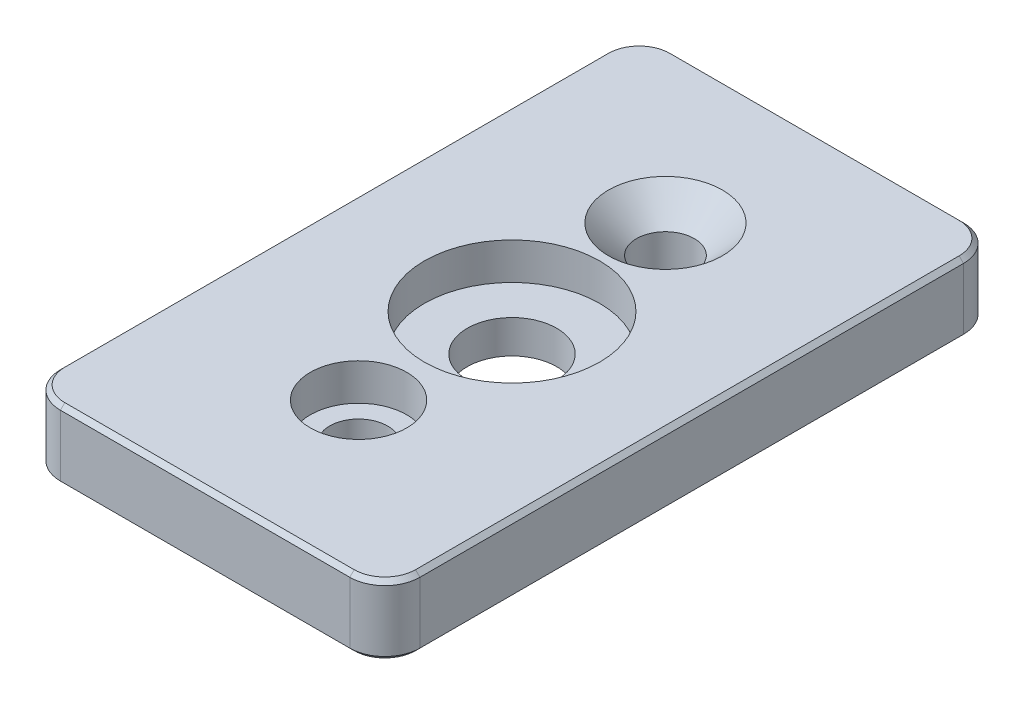
ISO-10303-21;
HEADER;
FILE_DESCRIPTION(('STEP AP214'),'2;1');
FILE_NAME('part.step','',(''),(''),'','','');
FILE_SCHEMA(('AUTOMOTIVE_DESIGN { 1 0 10303 214 1 1 1 1 }'));
ENDSEC;
DATA;
#1=APPLICATION_CONTEXT('core data for automotive mechanical design processes');
#2=APPLICATION_PROTOCOL_DEFINITION('international standard','automotive_design',2000,#1);
#3=PRODUCT_CONTEXT('',#1,'mechanical');
#4=PRODUCT('Part','Part','',(#3));
#5=PRODUCT_RELATED_PRODUCT_CATEGORY('part','',(#4));
#6=PRODUCT_DEFINITION_FORMATION('','',#4);
#7=PRODUCT_DEFINITION_CONTEXT('part definition',#1,'design');
#8=PRODUCT_DEFINITION('design','',#6,#7);
#9=PRODUCT_DEFINITION_SHAPE('','',#8);
#10=(LENGTH_UNIT() NAMED_UNIT(*) SI_UNIT(.MILLI.,.METRE.));
#11=(NAMED_UNIT(*) PLANE_ANGLE_UNIT() SI_UNIT($,.RADIAN.));
#12=(NAMED_UNIT(*) SI_UNIT($,.STERADIAN.) SOLID_ANGLE_UNIT());
#13=UNCERTAINTY_MEASURE_WITH_UNIT(LENGTH_MEASURE(1.E-05),#10,'distance_accuracy_value','');
#14=(GEOMETRIC_REPRESENTATION_CONTEXT(3) GLOBAL_UNCERTAINTY_ASSIGNED_CONTEXT((#13)) GLOBAL_UNIT_ASSIGNED_CONTEXT((#10,
#11,#12)) REPRESENTATION_CONTEXT('',''));
#15=CARTESIAN_POINT('',(0.,0.,0.));
#16=DIRECTION('',(0.,0.,1.));
#17=DIRECTION('',(1.,0.,0.));
#18=AXIS2_PLACEMENT_3D('',#15,#16,#17);
#19=CARTESIAN_POINT('',(0.,0.,0.));
#20=DIRECTION('',(0.,1.,0.));
#21=DIRECTION('',(0.,0.,1.));
#22=AXIS2_PLACEMENT_3D('',#19,#20,#21);
#23=CYLINDRICAL_SURFACE('',#22,5.1);
#24=CARTESIAN_POINT('',(0.,0.,0.));
#25=DIRECTION('',(0.,1.,0.));
#26=DIRECTION('',(0.,0.,1.));
#27=AXIS2_PLACEMENT_3D('',#24,#25,#26);
#28=CIRCLE('',#27,5.1);
#29=CARTESIAN_POINT('',(0.,0.,5.1));
#30=VERTEX_POINT('',#29);
#31=EDGE_CURVE('E332',#30,#30,#28,.T.);
#32=ORIENTED_EDGE('',*,*,#31,.F.);
#33=EDGE_LOOP('',(#32));
#34=FACE_BOUND('',#33,.T.);
#35=CARTESIAN_POINT('',(0.,3.8,0.));
#36=DIRECTION('',(0.,1.,0.));
#37=DIRECTION('',(0.,0.,1.));
#38=AXIS2_PLACEMENT_3D('',#35,#36,#37);
#39=CIRCLE('',#38,5.1);
#40=CARTESIAN_POINT('',(0.,3.8,5.1));
#41=VERTEX_POINT('',#40);
#42=EDGE_CURVE('E46',#41,#41,#39,.F.);
#43=ORIENTED_EDGE('',*,*,#42,.F.);
#44=EDGE_LOOP('',(#43));
#45=FACE_BOUND('',#44,.T.);
#46=ADVANCED_FACE('F41',(#34,#45),#23,.F.);
#47=CARTESIAN_POINT('',(0.,8.,17.5));
#48=DIRECTION('',(0.,-1.,0.));
#49=DIRECTION('',(0.,0.,-1.));
#50=AXIS2_PLACEMENT_3D('',#47,#48,#49);
#51=CYLINDRICAL_SURFACE('',#50,3.3);
#52=CARTESIAN_POINT('',(0.,0.,17.5));
#53=DIRECTION('',(0.,1.,0.));
#54=DIRECTION('',(0.,0.,1.));
#55=AXIS2_PLACEMENT_3D('',#52,#53,#54);
#56=CIRCLE('',#55,3.3);
#57=CARTESIAN_POINT('',(0.,0.,20.8));
#58=VERTEX_POINT('',#57);
#59=EDGE_CURVE('E455',#58,#58,#56,.T.);
#60=ORIENTED_EDGE('',*,*,#59,.F.);
#61=EDGE_LOOP('',(#60));
#62=FACE_BOUND('',#61,.T.);
#63=CARTESIAN_POINT('',(0.,3.8,17.5));
#64=DIRECTION('',(0.,1.,0.));
#65=DIRECTION('',(0.,0.,1.));
#66=AXIS2_PLACEMENT_3D('',#63,#64,#65);
#67=CIRCLE('',#66,3.3);
#68=CARTESIAN_POINT('',(0.,3.8,20.8));
#69=VERTEX_POINT('',#68);
#70=EDGE_CURVE('E451',#69,#69,#67,.T.);
#71=ORIENTED_EDGE('',*,*,#70,.T.);
#72=EDGE_LOOP('',(#71));
#73=FACE_BOUND('',#72,.T.);
#74=ADVANCED_FACE('F488',(#62,#73),#51,.F.);
#75=CARTESIAN_POINT('',(0.,8.,0.));
#76=DIRECTION('',(0.,-1.,0.));
#77=DIRECTION('',(0.,0.,-1.));
#78=AXIS2_PLACEMENT_3D('',#75,#76,#77);
#79=PLANE('',#78);
#80=CARTESIAN_POINT('',(0.,8.,0.));
#81=DIRECTION('',(0.,1.,0.));
#82=DIRECTION('',(0.,0.,1.));
#83=AXIS2_PLACEMENT_3D('',#80,#81,#82);
#84=CIRCLE('',#83,10.);
#85=CARTESIAN_POINT('',(0.,8.,10.));
#86=VERTEX_POINT('',#85);
#87=EDGE_CURVE('E472',#86,#86,#84,.T.);
#88=ORIENTED_EDGE('',*,*,#87,.F.);
#89=EDGE_LOOP('',(#88));
#90=FACE_BOUND('',#89,.T.);
#91=CARTESIAN_POINT('',(-16.5,8.,-31.));
#92=DIRECTION('',(0.,-1.,0.));
#93=DIRECTION('',(0.,0.,-1.));
#94=AXIS2_PLACEMENT_3D('',#91,#92,#93);
#95=CIRCLE('',#94,3.50000000000001);
#96=CARTESIAN_POINT('',(-16.5,8.,-34.5));
#97=VERTEX_POINT('',#96);
#98=CARTESIAN_POINT('',(-20.,8.,-31.));
#99=VERTEX_POINT('',#98);
#100=EDGE_CURVE('E284',#97,#99,#95,.F.);
#101=ORIENTED_EDGE('',*,*,#100,.T.);
#102=DIRECTION('',(0.,0.,1.));
#103=VECTOR('',#102,1.);
#104=CARTESIAN_POINT('',(-20.,8.,0.));
#105=LINE('',#104,#103);
#106=CARTESIAN_POINT('',(-20.,8.,31.));
#107=VERTEX_POINT('',#106);
#108=EDGE_CURVE('E11',#99,#107,#105,.T.);
#109=ORIENTED_EDGE('',*,*,#108,.T.);
#110=CARTESIAN_POINT('',(-16.5,8.,31.));
#111=DIRECTION('',(0.,-1.,0.));
#112=DIRECTION('',(0.,0.,-1.));
#113=AXIS2_PLACEMENT_3D('',#110,#111,#112);
#114=CIRCLE('',#113,3.50000000000001);
#115=CARTESIAN_POINT('',(-16.5,8.,34.5));
#116=VERTEX_POINT('',#115);
#117=EDGE_CURVE('E52',#107,#116,#114,.F.);
#118=ORIENTED_EDGE('',*,*,#117,.T.);
#119=DIRECTION('',(1.,0.,0.));
#120=VECTOR('',#119,1.);
#121=CARTESIAN_POINT('',(0.,8.,34.5));
#122=LINE('',#121,#120);
#123=CARTESIAN_POINT('',(16.5,8.,34.5));
#124=VERTEX_POINT('',#123);
#125=EDGE_CURVE('E299',#116,#124,#122,.T.);
#126=ORIENTED_EDGE('',*,*,#125,.T.);
#127=CARTESIAN_POINT('',(16.5,8.,31.));
#128=DIRECTION('',(0.,-1.,0.));
#129=DIRECTION('',(0.,0.,-1.));
#130=AXIS2_PLACEMENT_3D('',#127,#128,#129);
#131=CIRCLE('',#130,3.50000000000001);
#132=CARTESIAN_POINT('',(20.,8.,31.));
#133=VERTEX_POINT('',#132);
#134=EDGE_CURVE('E296',#124,#133,#131,.F.);
#135=ORIENTED_EDGE('',*,*,#134,.T.);
#136=DIRECTION('',(0.,0.,-1.));
#137=VECTOR('',#136,1.);
#138=CARTESIAN_POINT('',(20.,8.,0.));
#139=LINE('',#138,#137);
#140=CARTESIAN_POINT('',(20.,8.,-31.));
#141=VERTEX_POINT('',#140);
#142=EDGE_CURVE('E293',#133,#141,#139,.T.);
#143=ORIENTED_EDGE('',*,*,#142,.T.);
#144=CARTESIAN_POINT('',(16.5,8.,-31.));
#145=DIRECTION('',(0.,-1.,0.));
#146=DIRECTION('',(0.,0.,-1.));
#147=AXIS2_PLACEMENT_3D('',#144,#145,#146);
#148=CIRCLE('',#147,3.50000000000001);
#149=CARTESIAN_POINT('',(16.5,8.,-34.5));
#150=VERTEX_POINT('',#149);
#151=EDGE_CURVE('E290',#141,#150,#148,.F.);
#152=ORIENTED_EDGE('',*,*,#151,.T.);
#153=DIRECTION('',(-1.,0.,0.));
#154=VECTOR('',#153,1.);
#155=CARTESIAN_POINT('',(0.,8.,-34.5));
#156=LINE('',#155,#154);
#157=EDGE_CURVE('E287',#150,#97,#156,.T.);
#158=ORIENTED_EDGE('',*,*,#157,.T.);
#159=EDGE_LOOP('',(#101,#109,#118,#126,#135,#143,#152,#158));
#160=FACE_BOUND('',#159,.T.);
#161=CARTESIAN_POINT('',(0.,8.,-17.5));
#162=DIRECTION('',(0.,-1.,0.));
#163=DIRECTION('',(0.,0.,-1.));
#164=AXIS2_PLACEMENT_3D('',#161,#162,#163);
#165=CIRCLE('',#164,6.50000000000001);
#166=CARTESIAN_POINT('',(0.,8.,-24.));
#167=VERTEX_POINT('',#166);
#168=EDGE_CURVE('E440',#167,#167,#165,.T.);
#169=ORIENTED_EDGE('',*,*,#168,.T.);
#170=EDGE_LOOP('',(#169));
#171=FACE_BOUND('',#170,.T.);
#172=CARTESIAN_POINT('',(0.,8.,17.5));
#173=DIRECTION('',(0.,1.,0.));
#174=DIRECTION('',(0.,0.,1.));
#175=AXIS2_PLACEMENT_3D('',#172,#173,#174);
#176=CIRCLE('',#175,5.5);
#177=CARTESIAN_POINT('',(0.,8.,23.));
#178=VERTEX_POINT('',#177);
#179=EDGE_CURVE('E328',#178,#178,#176,.T.);
#180=ORIENTED_EDGE('',*,*,#179,.F.);
#181=EDGE_LOOP('',(#180));
#182=FACE_BOUND('',#181,.T.);
#183=ADVANCED_FACE('F426',(#90,#160,#171,#182),#79,.F.);
#184=CARTESIAN_POINT('',(0.,0.,0.));
#185=DIRECTION('',(0.,-1.,0.));
#186=DIRECTION('',(0.,0.,-1.));
#187=AXIS2_PLACEMENT_3D('',#184,#185,#186);
#188=PLANE('',#187);
#189=ORIENTED_EDGE('',*,*,#31,.T.);
#190=EDGE_LOOP('',(#189));
#191=FACE_BOUND('',#190,.T.);
#192=CARTESIAN_POINT('',(-16.5,0.,31.));
#193=DIRECTION('',(0.,-1.,0.));
#194=DIRECTION('',(0.,0.,-1.));
#195=AXIS2_PLACEMENT_3D('',#192,#193,#194);
#196=CIRCLE('',#195,3.5);
#197=CARTESIAN_POINT('',(-16.5,0.,34.5));
#198=VERTEX_POINT('',#197);
#199=CARTESIAN_POINT('',(-20.,0.,31.));
#200=VERTEX_POINT('',#199);
#201=EDGE_CURVE('E242',#198,#200,#196,.T.);
#202=ORIENTED_EDGE('',*,*,#201,.T.);
#203=DIRECTION('',(0.,0.,-1.));
#204=VECTOR('',#203,1.);
#205=CARTESIAN_POINT('',(-20.,0.,-31.));
#206=LINE('',#205,#204);
#207=CARTESIAN_POINT('',(-20.,0.,-31.));
#208=VERTEX_POINT('',#207);
#209=EDGE_CURVE('E165',#200,#208,#206,.T.);
#210=ORIENTED_EDGE('',*,*,#209,.T.);
#211=CARTESIAN_POINT('',(-16.5,0.,-31.));
#212=DIRECTION('',(0.,-1.,0.));
#213=DIRECTION('',(0.,0.,-1.));
#214=AXIS2_PLACEMENT_3D('',#211,#212,#213);
#215=CIRCLE('',#214,3.5);
#216=CARTESIAN_POINT('',(-16.5,0.,-34.5));
#217=VERTEX_POINT('',#216);
#218=EDGE_CURVE('E230',#208,#217,#215,.T.);
#219=ORIENTED_EDGE('',*,*,#218,.T.);
#220=DIRECTION('',(1.,0.,0.));
#221=VECTOR('',#220,1.);
#222=CARTESIAN_POINT('',(16.5,0.,-34.5));
#223=LINE('',#222,#221);
#224=CARTESIAN_POINT('',(16.5,0.,-34.5));
#225=VERTEX_POINT('',#224);
#226=EDGE_CURVE('E195',#217,#225,#223,.T.);
#227=ORIENTED_EDGE('',*,*,#226,.T.);
#228=CARTESIAN_POINT('',(16.5,0.,-31.));
#229=DIRECTION('',(0.,-1.,0.));
#230=DIRECTION('',(0.,0.,-1.));
#231=AXIS2_PLACEMENT_3D('',#228,#229,#230);
#232=CIRCLE('',#231,3.5);
#233=CARTESIAN_POINT('',(20.,0.,-31.));
#234=VERTEX_POINT('',#233);
#235=EDGE_CURVE('E227',#225,#234,#232,.T.);
#236=ORIENTED_EDGE('',*,*,#235,.T.);
#237=DIRECTION('',(0.,0.,1.));
#238=VECTOR('',#237,1.);
#239=CARTESIAN_POINT('',(20.,0.,31.));
#240=LINE('',#239,#238);
#241=CARTESIAN_POINT('',(20.,0.,31.));
#242=VERTEX_POINT('',#241);
#243=EDGE_CURVE('E233',#234,#242,#240,.T.);
#244=ORIENTED_EDGE('',*,*,#243,.T.);
#245=CARTESIAN_POINT('',(16.5,0.,31.));
#246=DIRECTION('',(0.,-1.,0.));
#247=DIRECTION('',(0.,0.,-1.));
#248=AXIS2_PLACEMENT_3D('',#245,#246,#247);
#249=CIRCLE('',#248,3.5);
#250=CARTESIAN_POINT('',(16.5,0.,34.5));
#251=VERTEX_POINT('',#250);
#252=EDGE_CURVE('E236',#242,#251,#249,.T.);
#253=ORIENTED_EDGE('',*,*,#252,.T.);
#254=DIRECTION('',(-1.,0.,0.));
#255=VECTOR('',#254,1.);
#256=CARTESIAN_POINT('',(-16.5,0.,34.5));
#257=LINE('',#256,#255);
#258=EDGE_CURVE('E239',#251,#198,#257,.T.);
#259=ORIENTED_EDGE('',*,*,#258,.T.);
#260=EDGE_LOOP('',(#202,#210,#219,#227,#236,#244,#253,#259));
#261=FACE_BOUND('',#260,.T.);
#262=CARTESIAN_POINT('',(0.,0.,-17.5));
#263=DIRECTION('',(0.,1.,0.));
#264=DIRECTION('',(0.,0.,1.));
#265=AXIS2_PLACEMENT_3D('',#262,#263,#264);
#266=CIRCLE('',#265,3.3);
#267=CARTESIAN_POINT('',(0.,0.,-14.2));
#268=VERTEX_POINT('',#267);
#269=EDGE_CURVE('E450',#268,#268,#266,.T.);
#270=ORIENTED_EDGE('',*,*,#269,.T.);
#271=EDGE_LOOP('',(#270));
#272=FACE_BOUND('',#271,.T.);
#273=ORIENTED_EDGE('',*,*,#59,.T.);
#274=EDGE_LOOP('',(#273));
#275=FACE_BOUND('',#274,.T.);
#276=ADVANCED_FACE('F388',(#191,#261,#272,#275),#188,.T.);
#277=CARTESIAN_POINT('',(20.5,8.,35.));
#278=DIRECTION('',(-1.,0.,0.));
#279=DIRECTION('',(0.,0.,1.));
#280=AXIS2_PLACEMENT_3D('',#277,#278,#279);
#281=PLANE('',#280);
#282=DIRECTION('',(0.,-1.,0.));
#283=VECTOR('',#282,1.);
#284=CARTESIAN_POINT('',(20.5,8.,31.));
#285=LINE('',#284,#283);
#286=CARTESIAN_POINT('',(20.5,7.5,31.));
#287=VERTEX_POINT('',#286);
#288=CARTESIAN_POINT('',(20.5,0.5,31.));
#289=VERTEX_POINT('',#288);
#290=EDGE_CURVE('E206',#287,#289,#285,.T.);
#291=ORIENTED_EDGE('',*,*,#290,.T.);
#292=DIRECTION('',(0.,0.,-1.));
#293=VECTOR('',#292,1.);
#294=CARTESIAN_POINT('',(20.5,0.5,-31.));
#295=LINE('',#294,#293);
#296=CARTESIAN_POINT('',(20.5,0.5,-31.));
#297=VERTEX_POINT('',#296);
#298=EDGE_CURVE('E263',#289,#297,#295,.T.);
#299=ORIENTED_EDGE('',*,*,#298,.T.);
#300=DIRECTION('',(0.,-1.,0.));
#301=VECTOR('',#300,1.);
#302=CARTESIAN_POINT('',(20.5,8.,-31.));
#303=LINE('',#302,#301);
#304=CARTESIAN_POINT('',(20.5,7.5,-31.));
#305=VERTEX_POINT('',#304);
#306=EDGE_CURVE('E201',#297,#305,#303,.F.);
#307=ORIENTED_EDGE('',*,*,#306,.T.);
#308=DIRECTION('',(0.,0.,1.));
#309=VECTOR('',#308,1.);
#310=CARTESIAN_POINT('',(20.5,7.5,35.));
#311=LINE('',#310,#309);
#312=EDGE_CURVE('E260',#305,#287,#311,.T.);
#313=ORIENTED_EDGE('',*,*,#312,.T.);
#314=EDGE_LOOP('',(#291,#299,#307,#313));
#315=FACE_BOUND('',#314,.T.);
#316=ADVANCED_FACE('F369',(#315),#281,.F.);
#317=CARTESIAN_POINT('',(-20.5,8.,-35.));
#318=DIRECTION('',(0.,0.,1.));
#319=DIRECTION('',(1.,0.,0.));
#320=AXIS2_PLACEMENT_3D('',#317,#318,#319);
#321=PLANE('',#320);
#322=DIRECTION('',(0.,-1.,0.));
#323=VECTOR('',#322,1.);
#324=CARTESIAN_POINT('',(16.5,8.,-35.));
#325=LINE('',#324,#323);
#326=CARTESIAN_POINT('',(16.5,7.5,-35.));
#327=VERTEX_POINT('',#326);
#328=CARTESIAN_POINT('',(16.5,0.5,-35.));
#329=VERTEX_POINT('',#328);
#330=EDGE_CURVE('E219',#327,#329,#325,.T.);
#331=ORIENTED_EDGE('',*,*,#330,.T.);
#332=DIRECTION('',(-1.,0.,0.));
#333=VECTOR('',#332,1.);
#334=CARTESIAN_POINT('',(-16.5,0.5,-35.));
#335=LINE('',#334,#333);
#336=CARTESIAN_POINT('',(-16.5,0.5,-35.));
#337=VERTEX_POINT('',#336);
#338=EDGE_CURVE('E281',#329,#337,#335,.T.);
#339=ORIENTED_EDGE('',*,*,#338,.T.);
#340=DIRECTION('',(0.,-1.,0.));
#341=VECTOR('',#340,1.);
#342=CARTESIAN_POINT('',(-16.5,8.,-35.));
#343=LINE('',#342,#341);
#344=CARTESIAN_POINT('',(-16.5,7.5,-35.));
#345=VERTEX_POINT('',#344);
#346=EDGE_CURVE('E215',#337,#345,#343,.F.);
#347=ORIENTED_EDGE('',*,*,#346,.T.);
#348=DIRECTION('',(1.,0.,0.));
#349=VECTOR('',#348,1.);
#350=CARTESIAN_POINT('',(-20.5,7.5,-35.));
#351=LINE('',#350,#349);
#352=EDGE_CURVE('E278',#345,#327,#351,.T.);
#353=ORIENTED_EDGE('',*,*,#352,.T.);
#354=EDGE_LOOP('',(#331,#339,#347,#353));
#355=FACE_BOUND('',#354,.T.);
#356=ADVANCED_FACE('F401',(#355),#321,.F.);
#357=CARTESIAN_POINT('',(-20.5,8.,35.));
#358=DIRECTION('',(1.,0.,0.));
#359=DIRECTION('',(0.,0.,-1.));
#360=AXIS2_PLACEMENT_3D('',#357,#358,#359);
#361=PLANE('',#360);
#362=DIRECTION('',(0.,-1.,0.));
#363=VECTOR('',#362,1.);
#364=CARTESIAN_POINT('',(-20.5,8.,-31.));
#365=LINE('',#364,#363);
#366=CARTESIAN_POINT('',(-20.5,7.5,-31.));
#367=VERTEX_POINT('',#366);
#368=CARTESIAN_POINT('',(-20.5,0.5,-31.));
#369=VERTEX_POINT('',#368);
#370=EDGE_CURVE('E192',#367,#369,#365,.T.);
#371=ORIENTED_EDGE('',*,*,#370,.T.);
#372=DIRECTION('',(0.,0.,1.));
#373=VECTOR('',#372,1.);
#374=CARTESIAN_POINT('',(-20.5,0.5,31.));
#375=LINE('',#374,#373);
#376=CARTESIAN_POINT('',(-20.5,0.5,31.));
#377=VERTEX_POINT('',#376);
#378=EDGE_CURVE('E163',#369,#377,#375,.T.);
#379=ORIENTED_EDGE('',*,*,#378,.T.);
#380=DIRECTION('',(0.,-1.,0.));
#381=VECTOR('',#380,1.);
#382=CARTESIAN_POINT('',(-20.5,8.,31.));
#383=LINE('',#382,#381);
#384=CARTESIAN_POINT('',(-20.5,7.5,31.));
#385=VERTEX_POINT('',#384);
#386=EDGE_CURVE('E190',#377,#385,#383,.F.);
#387=ORIENTED_EDGE('',*,*,#386,.T.);
#388=DIRECTION('',(0.,0.,-1.));
#389=VECTOR('',#388,1.);
#390=CARTESIAN_POINT('',(-20.5,7.5,35.));
#391=LINE('',#390,#389);
#392=EDGE_CURVE('E196',#385,#367,#391,.T.);
#393=ORIENTED_EDGE('',*,*,#392,.T.);
#394=EDGE_LOOP('',(#371,#379,#387,#393));
#395=FACE_BOUND('',#394,.T.);
#396=ADVANCED_FACE('F188',(#395),#361,.F.);
#397=CARTESIAN_POINT('',(-20.5,8.,35.));
#398=DIRECTION('',(0.,0.,-1.));
#399=DIRECTION('',(-1.,0.,0.));
#400=AXIS2_PLACEMENT_3D('',#397,#398,#399);
#401=PLANE('',#400);
#402=DIRECTION('',(0.,-1.,0.));
#403=VECTOR('',#402,1.);
#404=CARTESIAN_POINT('',(-16.5,8.,35.));
#405=LINE('',#404,#403);
#406=CARTESIAN_POINT('',(-16.5,7.5,35.));
#407=VERTEX_POINT('',#406);
#408=CARTESIAN_POINT('',(-16.5,0.5,35.));
#409=VERTEX_POINT('',#408);
#410=EDGE_CURVE('E208',#407,#409,#405,.T.);
#411=ORIENTED_EDGE('',*,*,#410,.T.);
#412=DIRECTION('',(1.,0.,0.));
#413=VECTOR('',#412,1.);
#414=CARTESIAN_POINT('',(16.5,0.5,35.));
#415=LINE('',#414,#413);
#416=CARTESIAN_POINT('',(16.5,0.5,35.));
#417=VERTEX_POINT('',#416);
#418=EDGE_CURVE('E251',#409,#417,#415,.T.);
#419=ORIENTED_EDGE('',*,*,#418,.T.);
#420=DIRECTION('',(0.,-1.,0.));
#421=VECTOR('',#420,1.);
#422=CARTESIAN_POINT('',(16.5,8.,35.));
#423=LINE('',#422,#421);
#424=CARTESIAN_POINT('',(16.5,7.5,35.));
#425=VERTEX_POINT('',#424);
#426=EDGE_CURVE('E377',#417,#425,#423,.F.);
#427=ORIENTED_EDGE('',*,*,#426,.T.);
#428=DIRECTION('',(-1.,0.,0.));
#429=VECTOR('',#428,1.);
#430=CARTESIAN_POINT('',(-20.5,7.5,35.));
#431=LINE('',#430,#429);
#432=EDGE_CURVE('E182',#425,#407,#431,.T.);
#433=ORIENTED_EDGE('',*,*,#432,.T.);
#434=EDGE_LOOP('',(#411,#419,#427,#433));
#435=FACE_BOUND('',#434,.T.);
#436=ADVANCED_FACE('F437',(#435),#401,.F.);
#437=CARTESIAN_POINT('',(0.,8.,-17.5));
#438=DIRECTION('',(0.,-1.,0.));
#439=DIRECTION('',(0.,0.,-1.));
#440=AXIS2_PLACEMENT_3D('',#437,#438,#439);
#441=CYLINDRICAL_SURFACE('',#440,3.3);
#442=CARTESIAN_POINT('',(0.,4.80000000000001,-17.5));
#443=DIRECTION('',(0.,-1.,0.));
#444=DIRECTION('',(0.,0.,-1.));
#445=AXIS2_PLACEMENT_3D('',#442,#443,#444);
#446=CIRCLE('',#445,3.3);
#447=CARTESIAN_POINT('',(0.,4.80000000000001,-20.8));
#448=VERTEX_POINT('',#447);
#449=EDGE_CURVE('E446',#448,#448,#446,.F.);
#450=ORIENTED_EDGE('',*,*,#449,.T.);
#451=EDGE_LOOP('',(#450));
#452=FACE_BOUND('',#451,.T.);
#453=ORIENTED_EDGE('',*,*,#269,.F.);
#454=EDGE_LOOP('',(#453));
#455=FACE_BOUND('',#454,.T.);
#456=ADVANCED_FACE('F508',(#452,#455),#441,.F.);
#457=CARTESIAN_POINT('',(0.,3.8,17.5));
#458=DIRECTION('',(0.,1.,0.));
#459=DIRECTION('',(0.,0.,1.));
#460=AXIS2_PLACEMENT_3D('',#457,#458,#459);
#461=CYLINDRICAL_SURFACE('',#460,5.5);
#462=CARTESIAN_POINT('',(0.,3.8,17.5));
#463=DIRECTION('',(0.,1.,0.));
#464=DIRECTION('',(0.,0.,1.));
#465=AXIS2_PLACEMENT_3D('',#462,#463,#464);
#466=CIRCLE('',#465,5.5);
#467=CARTESIAN_POINT('',(0.,3.8,23.));
#468=VERTEX_POINT('',#467);
#469=EDGE_CURVE('E456',#468,#468,#466,.T.);
#470=ORIENTED_EDGE('',*,*,#469,.F.);
#471=EDGE_LOOP('',(#470));
#472=FACE_BOUND('',#471,.T.);
#473=ORIENTED_EDGE('',*,*,#179,.T.);
#474=EDGE_LOOP('',(#473));
#475=FACE_BOUND('',#474,.T.);
#476=ADVANCED_FACE('F505',(#472,#475),#461,.F.);
#477=CARTESIAN_POINT('',(0.,3.8,17.5));
#478=DIRECTION('',(0.,1.,0.));
#479=DIRECTION('',(0.,0.,1.));
#480=AXIS2_PLACEMENT_3D('',#477,#478,#479);
#481=PLANE('',#480);
#482=ORIENTED_EDGE('',*,*,#70,.F.);
#483=EDGE_LOOP('',(#482));
#484=FACE_BOUND('',#483,.T.);
#485=ORIENTED_EDGE('',*,*,#469,.T.);
#486=EDGE_LOOP('',(#485));
#487=FACE_BOUND('',#486,.T.);
#488=ADVANCED_FACE('F501',(#484,#487),#481,.T.);
#489=CARTESIAN_POINT('',(0.,4.80000000000001,-17.5));
#490=DIRECTION('',(0.,1.,0.));
#491=DIRECTION('',(0.,0.,1.));
#492=AXIS2_PLACEMENT_3D('',#489,#490,#491);
#493=CONICAL_SURFACE('',#492,3.3,0.785398163397451);
#494=ORIENTED_EDGE('',*,*,#168,.F.);
#495=EDGE_LOOP('',(#494));
#496=FACE_BOUND('',#495,.T.);
#497=ORIENTED_EDGE('',*,*,#449,.F.);
#498=EDGE_LOOP('',(#497));
#499=FACE_BOUND('',#498,.T.);
#500=ADVANCED_FACE('F504',(#496,#499),#493,.F.);
#501=CARTESIAN_POINT('',(-16.5,8.,31.));
#502=DIRECTION('',(0.,-1.,0.));
#503=DIRECTION('',(0.,0.,-1.));
#504=AXIS2_PLACEMENT_3D('',#501,#502,#503);
#505=CYLINDRICAL_SURFACE('',#504,4.);
#506=ORIENTED_EDGE('',*,*,#386,.F.);
#507=CARTESIAN_POINT('',(-16.5,0.5,31.));
#508=DIRECTION('',(0.,-1.,0.));
#509=DIRECTION('',(0.,0.,-1.));
#510=AXIS2_PLACEMENT_3D('',#507,#508,#509);
#511=CIRCLE('',#510,4.);
#512=EDGE_CURVE('E173',#377,#409,#511,.F.);
#513=ORIENTED_EDGE('',*,*,#512,.T.);
#514=ORIENTED_EDGE('',*,*,#410,.F.);
#515=CARTESIAN_POINT('',(-16.5,7.5,31.));
#516=DIRECTION('',(0.,-1.,0.));
#517=DIRECTION('',(0.,0.,-1.));
#518=AXIS2_PLACEMENT_3D('',#515,#516,#517);
#519=CIRCLE('',#518,4.);
#520=EDGE_CURVE('E183',#407,#385,#519,.T.);
#521=ORIENTED_EDGE('',*,*,#520,.T.);
#522=EDGE_LOOP('',(#506,#513,#514,#521));
#523=FACE_BOUND('',#522,.T.);
#524=ADVANCED_FACE('F198',(#523),#505,.T.);
#525=CARTESIAN_POINT('',(16.5,8.,31.));
#526=DIRECTION('',(0.,-1.,0.));
#527=DIRECTION('',(0.,0.,-1.));
#528=AXIS2_PLACEMENT_3D('',#525,#526,#527);
#529=CYLINDRICAL_SURFACE('',#528,4.);
#530=ORIENTED_EDGE('',*,*,#426,.F.);
#531=CARTESIAN_POINT('',(16.5,0.5,31.));
#532=DIRECTION('',(0.,-1.,0.));
#533=DIRECTION('',(0.,0.,-1.));
#534=AXIS2_PLACEMENT_3D('',#531,#532,#533);
#535=CIRCLE('',#534,4.);
#536=EDGE_CURVE('E257',#417,#289,#535,.F.);
#537=ORIENTED_EDGE('',*,*,#536,.T.);
#538=ORIENTED_EDGE('',*,*,#290,.F.);
#539=CARTESIAN_POINT('',(16.5,7.5,31.));
#540=DIRECTION('',(0.,-1.,0.));
#541=DIRECTION('',(0.,0.,-1.));
#542=AXIS2_PLACEMENT_3D('',#539,#540,#541);
#543=CIRCLE('',#542,4.);
#544=EDGE_CURVE('E254',#287,#425,#543,.T.);
#545=ORIENTED_EDGE('',*,*,#544,.T.);
#546=EDGE_LOOP('',(#530,#537,#538,#545));
#547=FACE_BOUND('',#546,.T.);
#548=ADVANCED_FACE('F374',(#547),#529,.T.);
#549=CARTESIAN_POINT('',(16.5,8.,-31.));
#550=DIRECTION('',(0.,-1.,0.));
#551=DIRECTION('',(0.,0.,-1.));
#552=AXIS2_PLACEMENT_3D('',#549,#550,#551);
#553=CYLINDRICAL_SURFACE('',#552,4.);
#554=ORIENTED_EDGE('',*,*,#306,.F.);
#555=CARTESIAN_POINT('',(16.5,0.5,-31.));
#556=DIRECTION('',(0.,-1.,0.));
#557=DIRECTION('',(0.,0.,-1.));
#558=AXIS2_PLACEMENT_3D('',#555,#556,#557);
#559=CIRCLE('',#558,4.);
#560=EDGE_CURVE('E275',#297,#329,#559,.F.);
#561=ORIENTED_EDGE('',*,*,#560,.T.);
#562=ORIENTED_EDGE('',*,*,#330,.F.);
#563=CARTESIAN_POINT('',(16.5,7.5,-31.));
#564=DIRECTION('',(0.,-1.,0.));
#565=DIRECTION('',(0.,0.,-1.));
#566=AXIS2_PLACEMENT_3D('',#563,#564,#565);
#567=CIRCLE('',#566,4.);
#568=EDGE_CURVE('E272',#327,#305,#567,.T.);
#569=ORIENTED_EDGE('',*,*,#568,.T.);
#570=EDGE_LOOP('',(#554,#561,#562,#569));
#571=FACE_BOUND('',#570,.T.);
#572=ADVANCED_FACE('F397',(#571),#553,.T.);
#573=CARTESIAN_POINT('',(-16.5,8.,-31.));
#574=DIRECTION('',(0.,-1.,0.));
#575=DIRECTION('',(0.,0.,-1.));
#576=AXIS2_PLACEMENT_3D('',#573,#574,#575);
#577=CYLINDRICAL_SURFACE('',#576,4.);
#578=ORIENTED_EDGE('',*,*,#346,.F.);
#579=CARTESIAN_POINT('',(-16.5,0.5,-31.));
#580=DIRECTION('',(0.,-1.,0.));
#581=DIRECTION('',(0.,0.,-1.));
#582=AXIS2_PLACEMENT_3D('',#579,#580,#581);
#583=CIRCLE('',#582,4.);
#584=EDGE_CURVE('E269',#337,#369,#583,.F.);
#585=ORIENTED_EDGE('',*,*,#584,.T.);
#586=ORIENTED_EDGE('',*,*,#370,.F.);
#587=CARTESIAN_POINT('',(-16.5,7.5,-31.));
#588=DIRECTION('',(0.,-1.,0.));
#589=DIRECTION('',(0.,0.,-1.));
#590=AXIS2_PLACEMENT_3D('',#587,#588,#589);
#591=CIRCLE('',#590,4.);
#592=EDGE_CURVE('E266',#367,#345,#591,.T.);
#593=ORIENTED_EDGE('',*,*,#592,.T.);
#594=EDGE_LOOP('',(#578,#585,#586,#593));
#595=FACE_BOUND('',#594,.T.);
#596=ADVANCED_FACE('F416',(#595),#577,.T.);
#597=CARTESIAN_POINT('',(20.5,0.5,35.));
#598=DIRECTION('',(0.707106781186547,-0.707106781186547,0.));
#599=DIRECTION('',(0.,0.,1.));
#600=AXIS2_PLACEMENT_3D('',#597,#598,#599);
#601=PLANE('',#600);
#602=DIRECTION('',(0.707106781186547,0.707106781186547,0.));
#603=VECTOR('',#602,1.);
#604=CARTESIAN_POINT('',(20.,0.,31.));
#605=LINE('',#604,#603);
#606=EDGE_CURVE('E320',#242,#289,#605,.T.);
#607=ORIENTED_EDGE('',*,*,#606,.F.);
#608=ORIENTED_EDGE('',*,*,#243,.F.);
#609=DIRECTION('',(-0.707106781186547,-0.707106781186547,0.));
#610=VECTOR('',#609,1.);
#611=CARTESIAN_POINT('',(20.5,0.5,-31.));
#612=LINE('',#611,#610);
#613=EDGE_CURVE('E324',#297,#234,#612,.T.);
#614=ORIENTED_EDGE('',*,*,#613,.F.);
#615=ORIENTED_EDGE('',*,*,#298,.F.);
#616=EDGE_LOOP('',(#607,#608,#614,#615));
#617=FACE_BOUND('',#616,.T.);
#618=ADVANCED_FACE('F394',(#617),#601,.T.);
#619=CARTESIAN_POINT('',(16.5,0.,-31.));
#620=DIRECTION('',(0.,1.,0.));
#621=DIRECTION('',(0.,0.,1.));
#622=AXIS2_PLACEMENT_3D('',#619,#620,#621);
#623=CONICAL_SURFACE('',#622,3.5,0.785398163397448);
#624=ORIENTED_EDGE('',*,*,#613,.T.);
#625=ORIENTED_EDGE('',*,*,#235,.F.);
#626=DIRECTION('',(0.,-0.707106781186547,0.707106781186547));
#627=VECTOR('',#626,1.);
#628=CARTESIAN_POINT('',(16.5,0.5,-35.));
#629=LINE('',#628,#627);
#630=EDGE_CURVE('E316',#329,#225,#629,.T.);
#631=ORIENTED_EDGE('',*,*,#630,.F.);
#632=ORIENTED_EDGE('',*,*,#560,.F.);
#633=EDGE_LOOP('',(#624,#625,#631,#632));
#634=FACE_BOUND('',#633,.T.);
#635=ADVANCED_FACE('F406',(#634),#623,.T.);
#636=CARTESIAN_POINT('',(16.5,0.,31.));
#637=DIRECTION('',(0.,1.,0.));
#638=DIRECTION('',(0.,0.,1.));
#639=AXIS2_PLACEMENT_3D('',#636,#637,#638);
#640=CONICAL_SURFACE('',#639,3.5,0.785398163397448);
#641=ORIENTED_EDGE('',*,*,#606,.T.);
#642=ORIENTED_EDGE('',*,*,#536,.F.);
#643=DIRECTION('',(0.,0.707106781186547,0.707106781186547));
#644=VECTOR('',#643,1.);
#645=CARTESIAN_POINT('',(16.5,0.,34.5));
#646=LINE('',#645,#644);
#647=EDGE_CURVE('E312',#251,#417,#646,.T.);
#648=ORIENTED_EDGE('',*,*,#647,.F.);
#649=ORIENTED_EDGE('',*,*,#252,.F.);
#650=EDGE_LOOP('',(#641,#642,#648,#649));
#651=FACE_BOUND('',#650,.T.);
#652=ADVANCED_FACE('F380',(#651),#640,.T.);
#653=CARTESIAN_POINT('',(-20.5,0.5,-35.));
#654=DIRECTION('',(0.,-0.707106781186547,-0.707106781186547));
#655=DIRECTION('',(1.,0.,0.));
#656=AXIS2_PLACEMENT_3D('',#653,#654,#655);
#657=PLANE('',#656);
#658=ORIENTED_EDGE('',*,*,#630,.T.);
#659=ORIENTED_EDGE('',*,*,#226,.F.);
#660=DIRECTION('',(0.,-0.707106781186547,0.707106781186547));
#661=VECTOR('',#660,1.);
#662=CARTESIAN_POINT('',(-16.5,0.5,-35.));
#663=LINE('',#662,#661);
#664=EDGE_CURVE('E308',#337,#217,#663,.T.);
#665=ORIENTED_EDGE('',*,*,#664,.F.);
#666=ORIENTED_EDGE('',*,*,#338,.F.);
#667=EDGE_LOOP('',(#658,#659,#665,#666));
#668=FACE_BOUND('',#667,.T.);
#669=ADVANCED_FACE('F410',(#668),#657,.T.);
#670=CARTESIAN_POINT('',(-20.5,0.5,35.));
#671=DIRECTION('',(0.,-0.707106781186547,0.707106781186547));
#672=DIRECTION('',(-1.,0.,0.));
#673=AXIS2_PLACEMENT_3D('',#670,#671,#672);
#674=PLANE('',#673);
#675=ORIENTED_EDGE('',*,*,#647,.T.);
#676=ORIENTED_EDGE('',*,*,#418,.F.);
#677=DIRECTION('',(0.,0.707106781186547,0.707106781186547));
#678=VECTOR('',#677,1.);
#679=CARTESIAN_POINT('',(-16.5,0.,34.5));
#680=LINE('',#679,#678);
#681=EDGE_CURVE('E176',#198,#409,#680,.T.);
#682=ORIENTED_EDGE('',*,*,#681,.F.);
#683=ORIENTED_EDGE('',*,*,#258,.F.);
#684=EDGE_LOOP('',(#675,#676,#682,#683));
#685=FACE_BOUND('',#684,.T.);
#686=ADVANCED_FACE('F386',(#685),#674,.T.);
#687=CARTESIAN_POINT('',(-16.5,0.,-31.));
#688=DIRECTION('',(0.,1.,0.));
#689=DIRECTION('',(0.,0.,1.));
#690=AXIS2_PLACEMENT_3D('',#687,#688,#689);
#691=CONICAL_SURFACE('',#690,3.5,0.785398163397448);
#692=ORIENTED_EDGE('',*,*,#664,.T.);
#693=ORIENTED_EDGE('',*,*,#218,.F.);
#694=DIRECTION('',(0.70710678118655,-0.707106781186545,0.));
#695=VECTOR('',#694,1.);
#696=CARTESIAN_POINT('',(-20.5,0.5,-31.));
#697=LINE('',#696,#695);
#698=EDGE_CURVE('E169',#369,#208,#697,.T.);
#699=ORIENTED_EDGE('',*,*,#698,.F.);
#700=ORIENTED_EDGE('',*,*,#584,.F.);
#701=EDGE_LOOP('',(#692,#693,#699,#700));
#702=FACE_BOUND('',#701,.T.);
#703=ADVANCED_FACE('F414',(#702),#691,.T.);
#704=CARTESIAN_POINT('',(-16.5,0.,31.));
#705=DIRECTION('',(0.,1.,0.));
#706=DIRECTION('',(0.,0.,1.));
#707=AXIS2_PLACEMENT_3D('',#704,#705,#706);
#708=CONICAL_SURFACE('',#707,3.5,0.785398163397448);
#709=ORIENTED_EDGE('',*,*,#681,.T.);
#710=ORIENTED_EDGE('',*,*,#512,.F.);
#711=DIRECTION('',(-0.707106781186547,0.707106781186547,0.));
#712=VECTOR('',#711,1.);
#713=CARTESIAN_POINT('',(-20.,0.,31.));
#714=LINE('',#713,#712);
#715=EDGE_CURVE('E159',#200,#377,#714,.T.);
#716=ORIENTED_EDGE('',*,*,#715,.F.);
#717=ORIENTED_EDGE('',*,*,#201,.F.);
#718=EDGE_LOOP('',(#709,#710,#716,#717));
#719=FACE_BOUND('',#718,.T.);
#720=ADVANCED_FACE('F174',(#719),#708,.T.);
#721=CARTESIAN_POINT('',(-20.5,0.5,35.));
#722=DIRECTION('',(-0.707106781186547,-0.707106781186547,0.));
#723=DIRECTION('',(0.,0.,-1.));
#724=AXIS2_PLACEMENT_3D('',#721,#722,#723);
#725=PLANE('',#724);
#726=ORIENTED_EDGE('',*,*,#698,.T.);
#727=ORIENTED_EDGE('',*,*,#209,.F.);
#728=ORIENTED_EDGE('',*,*,#715,.T.);
#729=ORIENTED_EDGE('',*,*,#378,.F.);
#730=EDGE_LOOP('',(#726,#727,#728,#729));
#731=FACE_BOUND('',#730,.T.);
#732=ADVANCED_FACE('F161',(#731),#725,.T.);
#733=CARTESIAN_POINT('',(20.,8.,0.));
#734=DIRECTION('',(-0.707106781186552,-0.707106781186543,0.));
#735=DIRECTION('',(0.,0.,-1.));
#736=AXIS2_PLACEMENT_3D('',#733,#734,#735);
#737=PLANE('',#736);
#738=DIRECTION('',(-0.707106781186543,0.707106781186552,0.));
#739=VECTOR('',#738,1.);
#740=CARTESIAN_POINT('',(20.5,7.5,31.));
#741=LINE('',#740,#739);
#742=EDGE_CURVE('E351',#287,#133,#741,.T.);
#743=ORIENTED_EDGE('',*,*,#742,.F.);
#744=ORIENTED_EDGE('',*,*,#312,.F.);
#745=DIRECTION('',(0.707106781186543,-0.707106781186552,0.));
#746=VECTOR('',#745,1.);
#747=CARTESIAN_POINT('',(20.,8.,-31.));
#748=LINE('',#747,#746);
#749=EDGE_CURVE('E170',#141,#305,#748,.T.);
#750=ORIENTED_EDGE('',*,*,#749,.F.);
#751=ORIENTED_EDGE('',*,*,#142,.F.);
#752=EDGE_LOOP('',(#743,#744,#750,#751));
#753=FACE_BOUND('',#752,.T.);
#754=ADVANCED_FACE('F44',(#753),#737,.F.);
#755=CARTESIAN_POINT('',(16.5,8.,-31.));
#756=DIRECTION('',(0.,-1.,0.));
#757=DIRECTION('',(0.,0.,-1.));
#758=AXIS2_PLACEMENT_3D('',#755,#756,#757);
#759=CONICAL_SURFACE('',#758,3.50000000000001,0.785398163397445);
#760=ORIENTED_EDGE('',*,*,#749,.T.);
#761=ORIENTED_EDGE('',*,*,#568,.F.);
#762=DIRECTION('',(0.,-0.70710678118655,-0.707106781186545));
#763=VECTOR('',#762,1.);
#764=CARTESIAN_POINT('',(16.5,8.,-34.5));
#765=LINE('',#764,#763);
#766=EDGE_CURVE('E347',#150,#327,#765,.T.);
#767=ORIENTED_EDGE('',*,*,#766,.F.);
#768=ORIENTED_EDGE('',*,*,#151,.F.);
#769=EDGE_LOOP('',(#760,#761,#767,#768));
#770=FACE_BOUND('',#769,.T.);
#771=ADVANCED_FACE('F360',(#770),#759,.T.);
#772=CARTESIAN_POINT('',(16.5,8.,31.));
#773=DIRECTION('',(0.,-1.,0.));
#774=DIRECTION('',(0.,0.,-1.));
#775=AXIS2_PLACEMENT_3D('',#772,#773,#774);
#776=CONICAL_SURFACE('',#775,3.50000000000001,0.785398163397441);
#777=ORIENTED_EDGE('',*,*,#742,.T.);
#778=ORIENTED_EDGE('',*,*,#134,.F.);
#779=DIRECTION('',(0.,0.70710678118655,-0.707106781186545));
#780=VECTOR('',#779,1.);
#781=CARTESIAN_POINT('',(16.5,7.5,35.));
#782=LINE('',#781,#780);
#783=EDGE_CURVE('E343',#425,#124,#782,.T.);
#784=ORIENTED_EDGE('',*,*,#783,.F.);
#785=ORIENTED_EDGE('',*,*,#544,.F.);
#786=EDGE_LOOP('',(#777,#778,#784,#785));
#787=FACE_BOUND('',#786,.T.);
#788=ADVANCED_FACE('F431',(#787),#776,.T.);
#789=CARTESIAN_POINT('',(0.,8.,-34.5));
#790=DIRECTION('',(0.,-0.707106781186545,0.70710678118655));
#791=DIRECTION('',(-1.,0.,0.));
#792=AXIS2_PLACEMENT_3D('',#789,#790,#791);
#793=PLANE('',#792);
#794=ORIENTED_EDGE('',*,*,#766,.T.);
#795=ORIENTED_EDGE('',*,*,#352,.F.);
#796=DIRECTION('',(0.,-0.70710678118655,-0.707106781186545));
#797=VECTOR('',#796,1.);
#798=CARTESIAN_POINT('',(-16.5,8.,-34.5));
#799=LINE('',#798,#797);
#800=EDGE_CURVE('E339',#97,#345,#799,.T.);
#801=ORIENTED_EDGE('',*,*,#800,.F.);
#802=ORIENTED_EDGE('',*,*,#157,.F.);
#803=EDGE_LOOP('',(#794,#795,#801,#802));
#804=FACE_BOUND('',#803,.T.);
#805=ADVANCED_FACE('F420',(#804),#793,.F.);
#806=CARTESIAN_POINT('',(0.,8.,34.5));
#807=DIRECTION('',(0.,-0.707106781186545,-0.70710678118655));
#808=DIRECTION('',(1.,0.,0.));
#809=AXIS2_PLACEMENT_3D('',#806,#807,#808);
#810=PLANE('',#809);
#811=ORIENTED_EDGE('',*,*,#783,.T.);
#812=ORIENTED_EDGE('',*,*,#125,.F.);
#813=DIRECTION('',(0.,0.70710678118655,-0.707106781186545));
#814=VECTOR('',#813,1.);
#815=CARTESIAN_POINT('',(-16.5,7.5,35.));
#816=LINE('',#815,#814);
#817=EDGE_CURVE('E335',#407,#116,#816,.T.);
#818=ORIENTED_EDGE('',*,*,#817,.F.);
#819=ORIENTED_EDGE('',*,*,#432,.F.);
#820=EDGE_LOOP('',(#811,#812,#818,#819));
#821=FACE_BOUND('',#820,.T.);
#822=ADVANCED_FACE('F434',(#821),#810,.F.);
#823=CARTESIAN_POINT('',(-16.5,8.,-31.));
#824=DIRECTION('',(0.,-1.,0.));
#825=DIRECTION('',(0.,0.,-1.));
#826=AXIS2_PLACEMENT_3D('',#823,#824,#825);
#827=CONICAL_SURFACE('',#826,3.50000000000001,0.785398163397441);
#828=ORIENTED_EDGE('',*,*,#800,.T.);
#829=ORIENTED_EDGE('',*,*,#592,.F.);
#830=DIRECTION('',(-0.707106781186543,-0.707106781186552,0.));
#831=VECTOR('',#830,1.);
#832=CARTESIAN_POINT('',(-20.,8.,-31.));
#833=LINE('',#832,#831);
#834=EDGE_CURVE('E331',#99,#367,#833,.T.);
#835=ORIENTED_EDGE('',*,*,#834,.F.);
#836=ORIENTED_EDGE('',*,*,#100,.F.);
#837=EDGE_LOOP('',(#828,#829,#835,#836));
#838=FACE_BOUND('',#837,.T.);
#839=ADVANCED_FACE('F424',(#838),#827,.T.);
#840=CARTESIAN_POINT('',(-16.5,8.,31.));
#841=DIRECTION('',(0.,-1.,0.));
#842=DIRECTION('',(0.,0.,-1.));
#843=AXIS2_PLACEMENT_3D('',#840,#841,#842);
#844=CONICAL_SURFACE('',#843,3.50000000000001,0.785398163397445);
#845=ORIENTED_EDGE('',*,*,#817,.T.);
#846=ORIENTED_EDGE('',*,*,#117,.F.);
#847=DIRECTION('',(0.707106781186545,0.70710678118655,0.));
#848=VECTOR('',#847,1.);
#849=CARTESIAN_POINT('',(-20.5,7.5,31.));
#850=LINE('',#849,#848);
#851=EDGE_CURVE('E60',#385,#107,#850,.T.);
#852=ORIENTED_EDGE('',*,*,#851,.F.);
#853=ORIENTED_EDGE('',*,*,#520,.F.);
#854=EDGE_LOOP('',(#845,#846,#852,#853));
#855=FACE_BOUND('',#854,.T.);
#856=ADVANCED_FACE('F589',(#855),#844,.T.);
#857=CARTESIAN_POINT('',(-20.,8.,0.));
#858=DIRECTION('',(0.707106781186552,-0.707106781186543,0.));
#859=DIRECTION('',(0.,0.,1.));
#860=AXIS2_PLACEMENT_3D('',#857,#858,#859);
#861=PLANE('',#860);
#862=ORIENTED_EDGE('',*,*,#834,.T.);
#863=ORIENTED_EDGE('',*,*,#392,.F.);
#864=ORIENTED_EDGE('',*,*,#851,.T.);
#865=ORIENTED_EDGE('',*,*,#108,.F.);
#866=EDGE_LOOP('',(#862,#863,#864,#865));
#867=FACE_BOUND('',#866,.T.);
#868=ADVANCED_FACE('F583',(#867),#861,.F.);
#869=CARTESIAN_POINT('',(0.,3.8,0.));
#870=DIRECTION('',(0.,1.,0.));
#871=DIRECTION('',(0.,0.,1.));
#872=AXIS2_PLACEMENT_3D('',#869,#870,#871);
#873=PLANE('',#872);
#874=CARTESIAN_POINT('',(0.,3.8,0.));
#875=DIRECTION('',(0.,1.,0.));
#876=DIRECTION('',(0.,0.,1.));
#877=AXIS2_PLACEMENT_3D('',#874,#875,#876);
#878=CIRCLE('',#877,10.);
#879=CARTESIAN_POINT('',(0.,3.8,10.));
#880=VERTEX_POINT('',#879);
#881=EDGE_CURVE('E476',#880,#880,#878,.T.);
#882=ORIENTED_EDGE('',*,*,#881,.T.);
#883=EDGE_LOOP('',(#882));
#884=FACE_BOUND('',#883,.T.);
#885=ORIENTED_EDGE('',*,*,#42,.T.);
#886=EDGE_LOOP('',(#885));
#887=FACE_BOUND('',#886,.T.);
#888=ADVANCED_FACE('F485',(#884,#887),#873,.T.);
#889=CARTESIAN_POINT('',(0.,3.8,0.));
#890=DIRECTION('',(0.,1.,0.));
#891=DIRECTION('',(0.,0.,1.));
#892=AXIS2_PLACEMENT_3D('',#889,#890,#891);
#893=CYLINDRICAL_SURFACE('',#892,10.);
#894=ORIENTED_EDGE('',*,*,#881,.F.);
#895=EDGE_LOOP('',(#894));
#896=FACE_BOUND('',#895,.T.);
#897=ORIENTED_EDGE('',*,*,#87,.T.);
#898=EDGE_LOOP('',(#897));
#899=FACE_BOUND('',#898,.T.);
#900=ADVANCED_FACE('F499',(#896,#899),#893,.F.);
#901=CLOSED_SHELL('',(#46,#74,#183,#276,#316,#356,#396,#436,#456,#476,#488,#500,#524,#548,#572,
#596,#618,#635,#652,#669,#686,#703,#720,#732,#754,#771,#788,#805,#822,#839,#856,#868,#888,#900));
#902=MANIFOLD_SOLID_BREP('B2',#901);
#903=ADVANCED_BREP_SHAPE_REPRESENTATION('',(#18,#902),#14);
#904=SHAPE_DEFINITION_REPRESENTATION(#9,#903);
ENDSEC;
END-ISO-10303-21;
